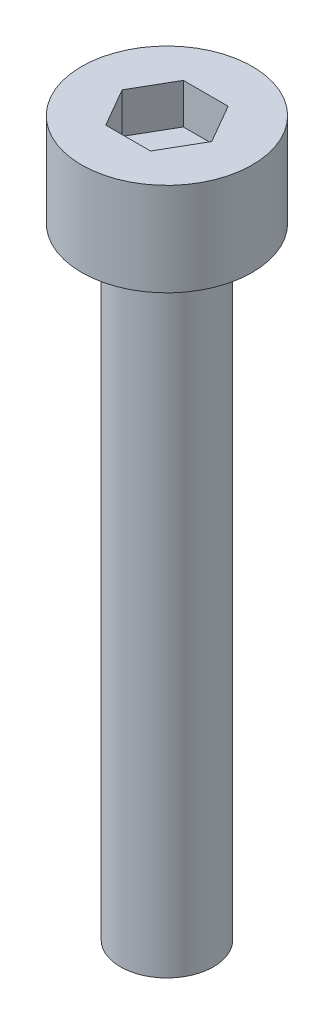
ISO-10303-21;
HEADER;
FILE_DESCRIPTION(('STEP AP214'),'2;1');
FILE_NAME('part.step','',(''),(''),'','','');
FILE_SCHEMA(('AUTOMOTIVE_DESIGN { 1 0 10303 214 1 1 1 1 }'));
ENDSEC;
DATA;
#1=APPLICATION_CONTEXT('core data for automotive mechanical design processes');
#2=APPLICATION_PROTOCOL_DEFINITION('international standard','automotive_design',2000,#1);
#3=PRODUCT_CONTEXT('',#1,'mechanical');
#4=PRODUCT('Part','Part','',(#3));
#5=PRODUCT_RELATED_PRODUCT_CATEGORY('part','',(#4));
#6=PRODUCT_DEFINITION_FORMATION('','',#4);
#7=PRODUCT_DEFINITION_CONTEXT('part definition',#1,'design');
#8=PRODUCT_DEFINITION('design','',#6,#7);
#9=PRODUCT_DEFINITION_SHAPE('','',#8);
#10=(LENGTH_UNIT() NAMED_UNIT(*) SI_UNIT(.MILLI.,.METRE.));
#11=(NAMED_UNIT(*) PLANE_ANGLE_UNIT() SI_UNIT($,.RADIAN.));
#12=(NAMED_UNIT(*) SI_UNIT($,.STERADIAN.) SOLID_ANGLE_UNIT());
#13=UNCERTAINTY_MEASURE_WITH_UNIT(LENGTH_MEASURE(1.E-05),#10,'distance_accuracy_value','');
#14=(GEOMETRIC_REPRESENTATION_CONTEXT(3) GLOBAL_UNCERTAINTY_ASSIGNED_CONTEXT((#13)) GLOBAL_UNIT_ASSIGNED_CONTEXT((#10,
#11,#12)) REPRESENTATION_CONTEXT('',''));
#15=CARTESIAN_POINT('',(0.,0.,0.));
#16=DIRECTION('',(0.,0.,1.));
#17=DIRECTION('',(1.,0.,0.));
#18=AXIS2_PLACEMENT_3D('',#15,#16,#17);
#19=CARTESIAN_POINT('',(0.,3.,0.));
#20=DIRECTION('',(0.,-1.,0.));
#21=DIRECTION('',(0.,0.,-1.));
#22=AXIS2_PLACEMENT_3D('',#19,#20,#21);
#23=CYLINDRICAL_SURFACE('',#22,2.75);
#24=CARTESIAN_POINT('',(0.,3.,0.));
#25=DIRECTION('',(0.,1.,0.));
#26=DIRECTION('',(0.,0.,1.));
#27=AXIS2_PLACEMENT_3D('',#24,#25,#26);
#28=CIRCLE('',#27,2.75);
#29=CARTESIAN_POINT('',(0.,3.,2.75));
#30=VERTEX_POINT('',#29);
#31=EDGE_CURVE('E45',#30,#30,#28,.T.);
#32=ORIENTED_EDGE('',*,*,#31,.F.);
#33=EDGE_LOOP('',(#32));
#34=FACE_BOUND('',#33,.T.);
#35=CARTESIAN_POINT('',(0.,0.,0.));
#36=DIRECTION('',(0.,1.,0.));
#37=DIRECTION('',(0.,0.,1.));
#38=AXIS2_PLACEMENT_3D('',#35,#36,#37);
#39=CIRCLE('',#38,2.75);
#40=CARTESIAN_POINT('',(0.,0.,2.75));
#41=VERTEX_POINT('',#40);
#42=EDGE_CURVE('E40',#41,#41,#39,.T.);
#43=ORIENTED_EDGE('',*,*,#42,.T.);
#44=EDGE_LOOP('',(#43));
#45=FACE_BOUND('',#44,.T.);
#46=ADVANCED_FACE('F37',(#34,#45),#23,.T.);
#47=CARTESIAN_POINT('',(0.,3.,0.));
#48=DIRECTION('',(0.,1.,0.));
#49=DIRECTION('',(0.,0.,1.));
#50=AXIS2_PLACEMENT_3D('',#47,#48,#49);
#51=PLANE('',#50);
#52=DIRECTION('',(0.5,0.,-0.866025403784439));
#53=VECTOR('',#52,1.);
#54=CARTESIAN_POINT('',(0.721687836487032,3.,1.25));
#55=LINE('',#54,#53);
#56=CARTESIAN_POINT('',(0.721687836487032,3.,1.25));
#57=VERTEX_POINT('',#56);
#58=CARTESIAN_POINT('',(1.44337567297406,3.,0.));
#59=VERTEX_POINT('',#58);
#60=EDGE_CURVE('E53',#57,#59,#55,.T.);
#61=ORIENTED_EDGE('',*,*,#60,.F.);
#62=DIRECTION('',(1.,0.,0.));
#63=VECTOR('',#62,1.);
#64=CARTESIAN_POINT('',(-0.721687836487033,3.,1.25));
#65=LINE('',#64,#63);
#66=CARTESIAN_POINT('',(-0.721687836487033,3.,1.25));
#67=VERTEX_POINT('',#66);
#68=EDGE_CURVE('E137',#67,#57,#65,.T.);
#69=ORIENTED_EDGE('',*,*,#68,.F.);
#70=DIRECTION('',(0.5,0.,0.866025403784439));
#71=VECTOR('',#70,1.);
#72=CARTESIAN_POINT('',(-1.44337567297407,3.,0.));
#73=LINE('',#72,#71);
#74=CARTESIAN_POINT('',(-1.44337567297407,3.,0.));
#75=VERTEX_POINT('',#74);
#76=EDGE_CURVE('E135',#75,#67,#73,.T.);
#77=ORIENTED_EDGE('',*,*,#76,.F.);
#78=DIRECTION('',(-0.5,0.,0.866025403784438));
#79=VECTOR('',#78,1.);
#80=CARTESIAN_POINT('',(-0.721687836487033,3.,-1.25));
#81=LINE('',#80,#79);
#82=CARTESIAN_POINT('',(-0.721687836487033,3.,-1.25));
#83=VERTEX_POINT('',#82);
#84=EDGE_CURVE('E101',#83,#75,#81,.T.);
#85=ORIENTED_EDGE('',*,*,#84,.F.);
#86=DIRECTION('',(-1.,0.,0.));
#87=VECTOR('',#86,1.);
#88=CARTESIAN_POINT('',(0.721687836487032,3.,-1.25));
#89=LINE('',#88,#87);
#90=CARTESIAN_POINT('',(0.721687836487032,3.,-1.25));
#91=VERTEX_POINT('',#90);
#92=EDGE_CURVE('E131',#91,#83,#89,.T.);
#93=ORIENTED_EDGE('',*,*,#92,.F.);
#94=DIRECTION('',(-0.5,0.,-0.866025403784439));
#95=VECTOR('',#94,1.);
#96=CARTESIAN_POINT('',(1.44337567297406,3.,0.));
#97=LINE('',#96,#95);
#98=EDGE_CURVE('E127',#59,#91,#97,.T.);
#99=ORIENTED_EDGE('',*,*,#98,.F.);
#100=EDGE_LOOP('',(#61,#69,#77,#85,#93,#99));
#101=FACE_BOUND('',#100,.T.);
#102=ORIENTED_EDGE('',*,*,#31,.T.);
#103=EDGE_LOOP('',(#102));
#104=FACE_BOUND('',#103,.T.);
#105=ADVANCED_FACE('F155',(#101,#104),#51,.T.);
#106=CARTESIAN_POINT('',(0.,0.,0.));
#107=DIRECTION('',(0.,1.,0.));
#108=DIRECTION('',(0.,0.,1.));
#109=AXIS2_PLACEMENT_3D('',#106,#107,#108);
#110=PLANE('',#109);
#111=CARTESIAN_POINT('',(0.,0.,0.));
#112=DIRECTION('',(0.,-1.,0.));
#113=DIRECTION('',(0.,0.,-1.));
#114=AXIS2_PLACEMENT_3D('',#111,#112,#113);
#115=CIRCLE('',#114,1.5);
#116=CARTESIAN_POINT('',(0.,0.,-1.5));
#117=VERTEX_POINT('',#116);
#118=EDGE_CURVE('E11',#117,#117,#115,.T.);
#119=ORIENTED_EDGE('',*,*,#118,.F.);
#120=EDGE_LOOP('',(#119));
#121=FACE_BOUND('',#120,.T.);
#122=ORIENTED_EDGE('',*,*,#42,.F.);
#123=EDGE_LOOP('',(#122));
#124=FACE_BOUND('',#123,.T.);
#125=ADVANCED_FACE('F152',(#121,#124),#110,.F.);
#126=CARTESIAN_POINT('',(0.721687836487032,1.7,1.25));
#127=DIRECTION('',(0.866025403784439,0.,0.5));
#128=DIRECTION('',(0.5,0.,-0.866025403784439));
#129=AXIS2_PLACEMENT_3D('',#126,#127,#128);
#130=PLANE('',#129);
#131=ORIENTED_EDGE('',*,*,#60,.T.);
#132=DIRECTION('',(0.,1.,0.));
#133=VECTOR('',#132,1.);
#134=CARTESIAN_POINT('',(1.44337567297406,1.7,0.));
#135=LINE('',#134,#133);
#136=CARTESIAN_POINT('',(1.44337567297406,1.7,0.));
#137=VERTEX_POINT('',#136);
#138=EDGE_CURVE('E83',#137,#59,#135,.T.);
#139=ORIENTED_EDGE('',*,*,#138,.F.);
#140=DIRECTION('',(0.5,0.,-0.866025403784439));
#141=VECTOR('',#140,1.);
#142=CARTESIAN_POINT('',(0.721687836487032,1.7,1.25));
#143=LINE('',#142,#141);
#144=CARTESIAN_POINT('',(0.721687836487032,1.7,1.25));
#145=VERTEX_POINT('',#144);
#146=EDGE_CURVE('E139',#145,#137,#143,.T.);
#147=ORIENTED_EDGE('',*,*,#146,.F.);
#148=DIRECTION('',(0.,1.,0.));
#149=VECTOR('',#148,1.);
#150=CARTESIAN_POINT('',(0.721687836487032,1.7,1.25));
#151=LINE('',#150,#149);
#152=EDGE_CURVE('E61',#145,#57,#151,.T.);
#153=ORIENTED_EDGE('',*,*,#152,.T.);
#154=EDGE_LOOP('',(#131,#139,#147,#153));
#155=FACE_BOUND('',#154,.T.);
#156=ADVANCED_FACE('F154',(#155),#130,.F.);
#157=CARTESIAN_POINT('',(-0.721687836487033,1.7,1.25));
#158=DIRECTION('',(0.,0.,1.));
#159=DIRECTION('',(1.,0.,0.));
#160=AXIS2_PLACEMENT_3D('',#157,#158,#159);
#161=PLANE('',#160);
#162=ORIENTED_EDGE('',*,*,#68,.T.);
#163=ORIENTED_EDGE('',*,*,#152,.F.);
#164=DIRECTION('',(1.,0.,0.));
#165=VECTOR('',#164,1.);
#166=CARTESIAN_POINT('',(-0.721687836487033,1.7,1.25));
#167=LINE('',#166,#165);
#168=CARTESIAN_POINT('',(-0.721687836487033,1.7,1.25));
#169=VERTEX_POINT('',#168);
#170=EDGE_CURVE('E113',#169,#145,#167,.T.);
#171=ORIENTED_EDGE('',*,*,#170,.F.);
#172=DIRECTION('',(0.,1.,0.));
#173=VECTOR('',#172,1.);
#174=CARTESIAN_POINT('',(-0.721687836487033,1.7,1.25));
#175=LINE('',#174,#173);
#176=EDGE_CURVE('E105',#169,#67,#175,.T.);
#177=ORIENTED_EDGE('',*,*,#176,.T.);
#178=EDGE_LOOP('',(#162,#163,#171,#177));
#179=FACE_BOUND('',#178,.T.);
#180=ADVANCED_FACE('F161',(#179),#161,.F.);
#181=CARTESIAN_POINT('',(-1.44337567297407,1.7,0.));
#182=DIRECTION('',(-0.866025403784439,0.,0.5));
#183=DIRECTION('',(0.5,0.,0.866025403784439));
#184=AXIS2_PLACEMENT_3D('',#181,#182,#183);
#185=PLANE('',#184);
#186=ORIENTED_EDGE('',*,*,#76,.T.);
#187=ORIENTED_EDGE('',*,*,#176,.F.);
#188=DIRECTION('',(0.5,0.,0.866025403784439));
#189=VECTOR('',#188,1.);
#190=CARTESIAN_POINT('',(-1.44337567297407,1.7,0.));
#191=LINE('',#190,#189);
#192=CARTESIAN_POINT('',(-1.44337567297407,1.7,0.));
#193=VERTEX_POINT('',#192);
#194=EDGE_CURVE('E109',#193,#169,#191,.T.);
#195=ORIENTED_EDGE('',*,*,#194,.F.);
#196=DIRECTION('',(0.,1.,0.));
#197=VECTOR('',#196,1.);
#198=CARTESIAN_POINT('',(-1.44337567297407,1.7,0.));
#199=LINE('',#198,#197);
#200=EDGE_CURVE('E94',#193,#75,#199,.T.);
#201=ORIENTED_EDGE('',*,*,#200,.T.);
#202=EDGE_LOOP('',(#186,#187,#195,#201));
#203=FACE_BOUND('',#202,.T.);
#204=ADVANCED_FACE('F110',(#203),#185,.F.);
#205=CARTESIAN_POINT('',(-0.721687836487033,1.7,-1.25));
#206=DIRECTION('',(-0.866025403784439,0.,-0.5));
#207=DIRECTION('',(-0.5,0.,0.866025403784439));
#208=AXIS2_PLACEMENT_3D('',#205,#206,#207);
#209=PLANE('',#208);
#210=ORIENTED_EDGE('',*,*,#84,.T.);
#211=ORIENTED_EDGE('',*,*,#200,.F.);
#212=DIRECTION('',(-0.5,0.,0.866025403784438));
#213=VECTOR('',#212,1.);
#214=CARTESIAN_POINT('',(-0.721687836487033,1.7,-1.25));
#215=LINE('',#214,#213);
#216=CARTESIAN_POINT('',(-0.721687836487033,1.7,-1.25));
#217=VERTEX_POINT('',#216);
#218=EDGE_CURVE('E98',#217,#193,#215,.T.);
#219=ORIENTED_EDGE('',*,*,#218,.F.);
#220=DIRECTION('',(0.,1.,0.));
#221=VECTOR('',#220,1.);
#222=CARTESIAN_POINT('',(-0.721687836487033,1.7,-1.25));
#223=LINE('',#222,#221);
#224=EDGE_CURVE('E106',#217,#83,#223,.T.);
#225=ORIENTED_EDGE('',*,*,#224,.T.);
#226=EDGE_LOOP('',(#210,#211,#219,#225));
#227=FACE_BOUND('',#226,.T.);
#228=ADVANCED_FACE('F96',(#227),#209,.F.);
#229=CARTESIAN_POINT('',(0.721687836487032,1.7,-1.25));
#230=DIRECTION('',(0.,0.,-1.));
#231=DIRECTION('',(-1.,0.,0.));
#232=AXIS2_PLACEMENT_3D('',#229,#230,#231);
#233=PLANE('',#232);
#234=ORIENTED_EDGE('',*,*,#92,.T.);
#235=ORIENTED_EDGE('',*,*,#224,.F.);
#236=DIRECTION('',(-1.,0.,0.));
#237=VECTOR('',#236,1.);
#238=CARTESIAN_POINT('',(0.721687836487032,1.7,-1.25));
#239=LINE('',#238,#237);
#240=CARTESIAN_POINT('',(0.721687836487032,1.7,-1.25));
#241=VERTEX_POINT('',#240);
#242=EDGE_CURVE('E119',#241,#217,#239,.T.);
#243=ORIENTED_EDGE('',*,*,#242,.F.);
#244=DIRECTION('',(0.,1.,0.));
#245=VECTOR('',#244,1.);
#246=CARTESIAN_POINT('',(0.721687836487032,1.7,-1.25));
#247=LINE('',#246,#245);
#248=EDGE_CURVE('E143',#241,#91,#247,.T.);
#249=ORIENTED_EDGE('',*,*,#248,.T.);
#250=EDGE_LOOP('',(#234,#235,#243,#249));
#251=FACE_BOUND('',#250,.T.);
#252=ADVANCED_FACE('F206',(#251),#233,.F.);
#253=CARTESIAN_POINT('',(1.44337567297406,1.7,0.));
#254=DIRECTION('',(0.866025403784439,0.,-0.5));
#255=DIRECTION('',(-0.5,0.,-0.866025403784439));
#256=AXIS2_PLACEMENT_3D('',#253,#254,#255);
#257=PLANE('',#256);
#258=ORIENTED_EDGE('',*,*,#98,.T.);
#259=ORIENTED_EDGE('',*,*,#248,.F.);
#260=DIRECTION('',(-0.5,0.,-0.866025403784439));
#261=VECTOR('',#260,1.);
#262=CARTESIAN_POINT('',(1.44337567297406,1.7,0.));
#263=LINE('',#262,#261);
#264=EDGE_CURVE('E121',#137,#241,#263,.T.);
#265=ORIENTED_EDGE('',*,*,#264,.F.);
#266=ORIENTED_EDGE('',*,*,#138,.T.);
#267=EDGE_LOOP('',(#258,#259,#265,#266));
#268=FACE_BOUND('',#267,.T.);
#269=ADVANCED_FACE('F215',(#268),#257,.F.);
#270=CARTESIAN_POINT('',(0.,1.7,0.));
#271=DIRECTION('',(0.,1.,0.));
#272=DIRECTION('',(0.,0.,1.));
#273=AXIS2_PLACEMENT_3D('',#270,#271,#272);
#274=PLANE('',#273);
#275=ORIENTED_EDGE('',*,*,#146,.T.);
#276=ORIENTED_EDGE('',*,*,#264,.T.);
#277=ORIENTED_EDGE('',*,*,#242,.T.);
#278=ORIENTED_EDGE('',*,*,#218,.T.);
#279=ORIENTED_EDGE('',*,*,#194,.T.);
#280=ORIENTED_EDGE('',*,*,#170,.T.);
#281=EDGE_LOOP('',(#275,#276,#277,#278,#279,#280));
#282=FACE_BOUND('',#281,.T.);
#283=ADVANCED_FACE('F116',(#282),#274,.T.);
#284=CARTESIAN_POINT('',(0.,-20.,0.));
#285=DIRECTION('',(0.,1.,0.));
#286=DIRECTION('',(0.,0.,1.));
#287=AXIS2_PLACEMENT_3D('',#284,#285,#286);
#288=CYLINDRICAL_SURFACE('',#287,1.5);
#289=CARTESIAN_POINT('',(0.,-20.,0.));
#290=DIRECTION('',(0.,-1.,0.));
#291=DIRECTION('',(0.,0.,-1.));
#292=AXIS2_PLACEMENT_3D('',#289,#290,#291);
#293=CIRCLE('',#292,1.5);
#294=CARTESIAN_POINT('',(0.,-20.,-1.5));
#295=VERTEX_POINT('',#294);
#296=EDGE_CURVE('E128',#295,#295,#293,.T.);
#297=ORIENTED_EDGE('',*,*,#296,.F.);
#298=EDGE_LOOP('',(#297));
#299=FACE_BOUND('',#298,.T.);
#300=ORIENTED_EDGE('',*,*,#118,.T.);
#301=EDGE_LOOP('',(#300));
#302=FACE_BOUND('',#301,.T.);
#303=ADVANCED_FACE('F233',(#299,#302),#288,.T.);
#304=CARTESIAN_POINT('',(0.,-20.,0.));
#305=DIRECTION('',(0.,-1.,0.));
#306=DIRECTION('',(0.,0.,-1.));
#307=AXIS2_PLACEMENT_3D('',#304,#305,#306);
#308=PLANE('',#307);
#309=ORIENTED_EDGE('',*,*,#296,.T.);
#310=EDGE_LOOP('',(#309));
#311=FACE_BOUND('',#310,.T.);
#312=ADVANCED_FACE('F247',(#311),#308,.T.);
#313=CLOSED_SHELL('',(#46,#105,#125,#156,#180,#204,#228,#252,#269,#283,#303,#312));
#314=MANIFOLD_SOLID_BREP('B2',#313);
#315=ADVANCED_BREP_SHAPE_REPRESENTATION('',(#18,#314),#14);
#316=SHAPE_DEFINITION_REPRESENTATION(#9,#315);
ENDSEC;
END-ISO-10303-21;
